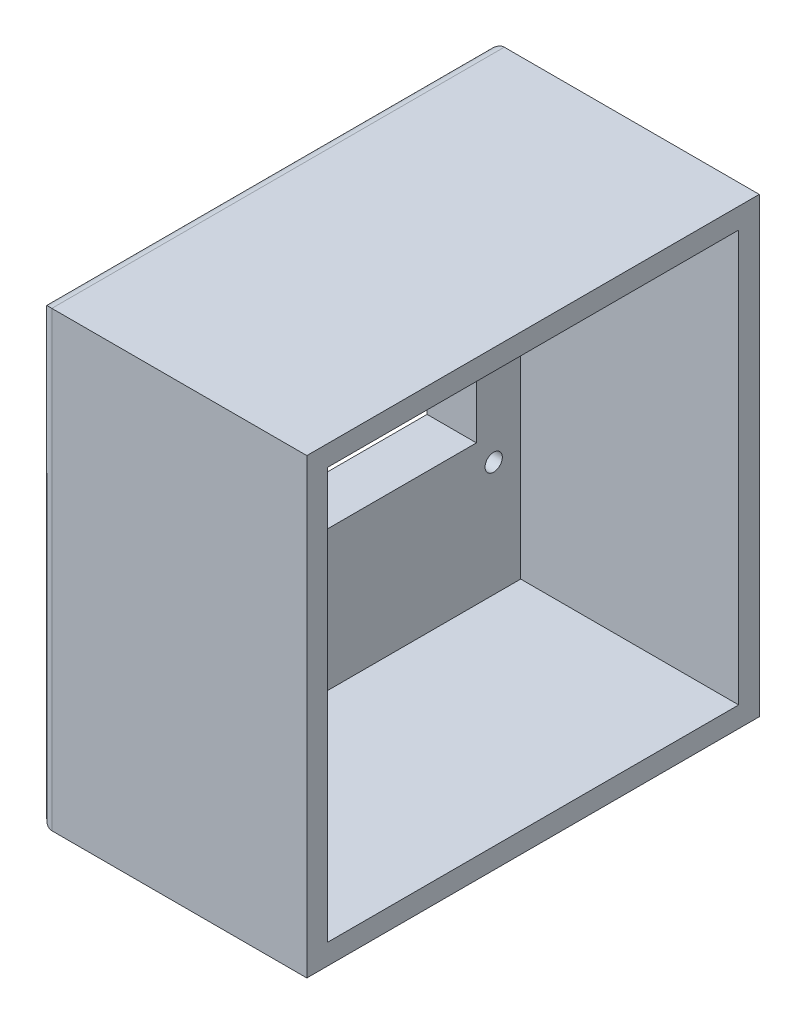
ISO-10303-21;
HEADER;
FILE_DESCRIPTION(('STEP AP214'),'2;1');
FILE_NAME('part.step','',(''),(''),'','','');
FILE_SCHEMA(('AUTOMOTIVE_DESIGN { 1 0 10303 214 1 1 1 1 }'));
ENDSEC;
DATA;
#1=APPLICATION_CONTEXT('core data for automotive mechanical design processes');
#2=APPLICATION_PROTOCOL_DEFINITION('international standard','automotive_design',2000,#1);
#3=PRODUCT_CONTEXT('',#1,'mechanical');
#4=PRODUCT('Part','Part','',(#3));
#5=PRODUCT_RELATED_PRODUCT_CATEGORY('part','',(#4));
#6=PRODUCT_DEFINITION_FORMATION('','',#4);
#7=PRODUCT_DEFINITION_CONTEXT('part definition',#1,'design');
#8=PRODUCT_DEFINITION('design','',#6,#7);
#9=PRODUCT_DEFINITION_SHAPE('','',#8);
#10=(LENGTH_UNIT() NAMED_UNIT(*) SI_UNIT(.MILLI.,.METRE.));
#11=(NAMED_UNIT(*) PLANE_ANGLE_UNIT() SI_UNIT($,.RADIAN.));
#12=(NAMED_UNIT(*) SI_UNIT($,.STERADIAN.) SOLID_ANGLE_UNIT());
#13=UNCERTAINTY_MEASURE_WITH_UNIT(LENGTH_MEASURE(1.E-05),#10,'distance_accuracy_value','');
#14=(GEOMETRIC_REPRESENTATION_CONTEXT(3) GLOBAL_UNCERTAINTY_ASSIGNED_CONTEXT((#13)) GLOBAL_UNIT_ASSIGNED_CONTEXT((#10,
#11,#12)) REPRESENTATION_CONTEXT('',''));
#15=CARTESIAN_POINT('',(0.,0.,0.));
#16=DIRECTION('',(0.,0.,1.));
#17=DIRECTION('',(1.,0.,0.));
#18=AXIS2_PLACEMENT_3D('',#15,#16,#17);
#19=CARTESIAN_POINT('',(12.,0.,0.));
#20=DIRECTION('',(-1.,0.,0.));
#21=DIRECTION('',(0.,0.,1.));
#22=AXIS2_PLACEMENT_3D('',#19,#20,#21);
#23=PLANE('',#22);
#24=DIRECTION('',(0.,0.,-1.));
#25=VECTOR('',#24,1.);
#26=CARTESIAN_POINT('',(12.,426.298918518807,375.220911044609));
#27=LINE('',#26,#25);
#28=CARTESIAN_POINT('',(12.,426.298918518807,455.220911044609));
#29=VERTEX_POINT('',#28);
#30=CARTESIAN_POINT('',(12.,426.298918518807,375.220911044609));
#31=VERTEX_POINT('',#30);
#32=EDGE_CURVE('E205',#29,#31,#27,.T.);
#33=ORIENTED_EDGE('',*,*,#32,.T.);
#34=DIRECTION('',(0.,-1.,0.));
#35=VECTOR('',#34,1.);
#36=CARTESIAN_POINT('',(12.,426.298918518807,375.220911044609));
#37=LINE('',#36,#35);
#38=CARTESIAN_POINT('',(12.,373.298918518807,375.220911044609));
#39=VERTEX_POINT('',#38);
#40=EDGE_CURVE('E195',#31,#39,#37,.T.);
#41=ORIENTED_EDGE('',*,*,#40,.T.);
#42=DIRECTION('',(0.,0.,1.));
#43=VECTOR('',#42,1.);
#44=CARTESIAN_POINT('',(12.,373.298918518807,375.220911044609));
#45=LINE('',#44,#43);
#46=CARTESIAN_POINT('',(12.,373.298918518807,455.220911044609));
#47=VERTEX_POINT('',#46);
#48=EDGE_CURVE('E198',#39,#47,#45,.T.);
#49=ORIENTED_EDGE('',*,*,#48,.T.);
#50=DIRECTION('',(0.,1.,0.));
#51=VECTOR('',#50,1.);
#52=CARTESIAN_POINT('',(12.,426.298918518807,455.220911044609));
#53=LINE('',#52,#51);
#54=EDGE_CURVE('E202',#47,#29,#53,.T.);
#55=ORIENTED_EDGE('',*,*,#54,.T.);
#56=EDGE_LOOP('',(#33,#41,#49,#55));
#57=FACE_BOUND('',#56,.T.);
#58=DIRECTION('',(0.,1.,0.));
#59=VECTOR('',#58,1.);
#60=CARTESIAN_POINT('',(12.,439.240771296059,364.454548573401));
#61=LINE('',#60,#59);
#62=CARTESIAN_POINT('',(12.,339.240771296059,364.454548573401));
#63=VERTEX_POINT('',#62);
#64=CARTESIAN_POINT('',(12.,439.240771296059,364.454548573401));
#65=VERTEX_POINT('',#64);
#66=EDGE_CURVE('E260',#63,#65,#61,.T.);
#67=ORIENTED_EDGE('',*,*,#66,.T.);
#68=DIRECTION('',(0.,0.,1.));
#69=VECTOR('',#68,1.);
#70=CARTESIAN_POINT('',(12.,439.240771296059,364.454548573401));
#71=LINE('',#70,#69);
#72=CARTESIAN_POINT('',(12.,439.240771296059,464.454548573401));
#73=VERTEX_POINT('',#72);
#74=EDGE_CURVE('E143',#65,#73,#71,.T.);
#75=ORIENTED_EDGE('',*,*,#74,.T.);
#76=DIRECTION('',(0.,-1.,0.));
#77=VECTOR('',#76,1.);
#78=CARTESIAN_POINT('',(12.,439.240771296059,464.454548573401));
#79=LINE('',#78,#77);
#80=CARTESIAN_POINT('',(12.,339.240771296059,464.454548573401));
#81=VERTEX_POINT('',#80);
#82=EDGE_CURVE('E265',#73,#81,#79,.T.);
#83=ORIENTED_EDGE('',*,*,#82,.T.);
#84=DIRECTION('',(0.,0.,-1.));
#85=VECTOR('',#84,1.);
#86=CARTESIAN_POINT('',(12.,339.240771296059,364.454548573401));
#87=LINE('',#86,#85);
#88=EDGE_CURVE('E268',#81,#63,#87,.T.);
#89=ORIENTED_EDGE('',*,*,#88,.T.);
#90=EDGE_LOOP('',(#67,#75,#83,#89));
#91=FACE_BOUND('',#90,.T.);
#92=CARTESIAN_POINT('',(12.,432.946200958038,371.07798761228));
#93=DIRECTION('',(1.,0.,0.));
#94=DIRECTION('',(0.,0.,-1.));
#95=AXIS2_PLACEMENT_3D('',#92,#93,#94);
#96=CIRCLE('',#95,2.09999973149244);
#97=CARTESIAN_POINT('',(12.,432.946200958038,368.977987880788));
#98=VERTEX_POINT('',#97);
#99=EDGE_CURVE('E257',#98,#98,#96,.T.);
#100=ORIENTED_EDGE('',*,*,#99,.F.);
#101=EDGE_LOOP('',(#100));
#102=FACE_BOUND('',#101,.T.);
#103=CARTESIAN_POINT('',(12.,367.14624514987,371.024063378591));
#104=DIRECTION('',(1.,0.,0.));
#105=DIRECTION('',(0.,0.,-1.));
#106=AXIS2_PLACEMENT_3D('',#103,#104,#105);
#107=CIRCLE('',#106,2.09999973149239);
#108=CARTESIAN_POINT('',(12.,367.14624514987,368.924063647098));
#109=VERTEX_POINT('',#108);
#110=EDGE_CURVE('E251',#109,#109,#107,.T.);
#111=ORIENTED_EDGE('',*,*,#110,.F.);
#112=EDGE_LOOP('',(#111));
#113=FACE_BOUND('',#112,.T.);
#114=CARTESIAN_POINT('',(12.,432.874247380097,458.877958128662));
#115=DIRECTION('',(1.,0.,0.));
#116=DIRECTION('',(0.,0.,-1.));
#117=AXIS2_PLACEMENT_3D('',#114,#115,#116);
#118=CIRCLE('',#117,2.09999973149244);
#119=CARTESIAN_POINT('',(12.,432.874247380097,456.777958397169));
#120=VERTEX_POINT('',#119);
#121=EDGE_CURVE('E245',#120,#120,#118,.T.);
#122=ORIENTED_EDGE('',*,*,#121,.F.);
#123=EDGE_LOOP('',(#122));
#124=FACE_BOUND('',#123,.T.);
#125=CARTESIAN_POINT('',(12.,367.074291571929,458.824033894972));
#126=DIRECTION('',(1.,0.,0.));
#127=DIRECTION('',(0.,0.,-1.));
#128=AXIS2_PLACEMENT_3D('',#125,#126,#127);
#129=CIRCLE('',#128,2.09999973149244);
#130=CARTESIAN_POINT('',(12.,367.074291571929,456.724034163479));
#131=VERTEX_POINT('',#130);
#132=EDGE_CURVE('E239',#131,#131,#129,.T.);
#133=ORIENTED_EDGE('',*,*,#132,.F.);
#134=EDGE_LOOP('',(#133));
#135=FACE_BOUND('',#134,.T.);
#136=CARTESIAN_POINT('',(12.,356.487124133319,451.165348634311));
#137=DIRECTION('',(1.,0.,0.));
#138=DIRECTION('',(0.,0.,-1.));
#139=AXIS2_PLACEMENT_3D('',#136,#137,#138);
#140=CIRCLE('',#139,3.49999949639457);
#141=CARTESIAN_POINT('',(12.,356.487124133319,447.665349137916));
#142=VERTEX_POINT('',#141);
#143=EDGE_CURVE('E233',#142,#142,#140,.T.);
#144=ORIENTED_EDGE('',*,*,#143,.F.);
#145=EDGE_LOOP('',(#144));
#146=FACE_BOUND('',#145,.T.);
#147=CARTESIAN_POINT('',(12.,356.508431567425,418.165360481469));
#148=DIRECTION('',(1.,0.,0.));
#149=DIRECTION('',(0.,0.,-1.));
#150=AXIS2_PLACEMENT_3D('',#147,#148,#149);
#151=CIRCLE('',#150,3.39999976505584);
#152=CARTESIAN_POINT('',(12.,356.508431567425,414.765360716413));
#153=VERTEX_POINT('',#152);
#154=EDGE_CURVE('E227',#153,#153,#151,.T.);
#155=ORIENTED_EDGE('',*,*,#154,.F.);
#156=EDGE_LOOP('',(#155));
#157=FACE_BOUND('',#156,.T.);
#158=ADVANCED_FACE('F33',(#57,#91,#102,#113,#124,#135,#146,#157),#23,.F.);
#159=CARTESIAN_POINT('',(0.,0.,0.));
#160=DIRECTION('',(-1.,0.,0.));
#161=DIRECTION('',(0.,0.,1.));
#162=AXIS2_PLACEMENT_3D('',#159,#160,#161);
#163=PLANE('',#162);
#164=DIRECTION('',(0.,-1.,0.));
#165=VECTOR('',#164,1.);
#166=CARTESIAN_POINT('',(0.,0.,362.454548573401));
#167=LINE('',#166,#165);
#168=CARTESIAN_POINT('',(0.,441.240771296059,362.454548573401));
#169=VERTEX_POINT('',#168);
#170=CARTESIAN_POINT('',(0.,337.240771296059,362.454548573401));
#171=VERTEX_POINT('',#170);
#172=EDGE_CURVE('E275',#169,#171,#167,.T.);
#173=ORIENTED_EDGE('',*,*,#172,.T.);
#174=DIRECTION('',(0.,0.,1.));
#175=VECTOR('',#174,1.);
#176=CARTESIAN_POINT('',(0.,337.240771296059,0.));
#177=LINE('',#176,#175);
#178=CARTESIAN_POINT('',(0.,337.240771296059,466.454548573401));
#179=VERTEX_POINT('',#178);
#180=EDGE_CURVE('E277',#171,#179,#177,.T.);
#181=ORIENTED_EDGE('',*,*,#180,.T.);
#182=DIRECTION('',(0.,1.,0.));
#183=VECTOR('',#182,1.);
#184=CARTESIAN_POINT('',(0.,0.,466.454548573401));
#185=LINE('',#184,#183);
#186=CARTESIAN_POINT('',(0.,441.240771296059,466.454548573401));
#187=VERTEX_POINT('',#186);
#188=EDGE_CURVE('E271',#179,#187,#185,.T.);
#189=ORIENTED_EDGE('',*,*,#188,.T.);
#190=DIRECTION('',(0.,0.,-1.));
#191=VECTOR('',#190,1.);
#192=CARTESIAN_POINT('',(0.,441.240771296059,0.));
#193=LINE('',#192,#191);
#194=EDGE_CURVE('E273',#187,#169,#193,.T.);
#195=ORIENTED_EDGE('',*,*,#194,.T.);
#196=EDGE_LOOP('',(#173,#181,#189,#195));
#197=FACE_BOUND('',#196,.T.);
#198=DIRECTION('',(0.,-1.,0.));
#199=VECTOR('',#198,1.);
#200=CARTESIAN_POINT('',(0.,426.298918518807,375.220911044609));
#201=LINE('',#200,#199);
#202=CARTESIAN_POINT('',(0.,426.298918518807,375.220911044609));
#203=VERTEX_POINT('',#202);
#204=CARTESIAN_POINT('',(0.,373.298918518807,375.220911044609));
#205=VERTEX_POINT('',#204);
#206=EDGE_CURVE('E188',#203,#205,#201,.T.);
#207=ORIENTED_EDGE('',*,*,#206,.F.);
#208=DIRECTION('',(0.,0.,-1.));
#209=VECTOR('',#208,1.);
#210=CARTESIAN_POINT('',(0.,426.298918518807,375.220911044609));
#211=LINE('',#210,#209);
#212=CARTESIAN_POINT('',(0.,426.298918518807,455.220911044609));
#213=VERTEX_POINT('',#212);
#214=EDGE_CURVE('E199',#213,#203,#211,.T.);
#215=ORIENTED_EDGE('',*,*,#214,.F.);
#216=DIRECTION('',(0.,1.,0.));
#217=VECTOR('',#216,1.);
#218=CARTESIAN_POINT('',(0.,426.298918518807,455.220911044609));
#219=LINE('',#218,#217);
#220=CARTESIAN_POINT('',(0.,373.298918518807,455.220911044609));
#221=VERTEX_POINT('',#220);
#222=EDGE_CURVE('E213',#221,#213,#219,.T.);
#223=ORIENTED_EDGE('',*,*,#222,.F.);
#224=DIRECTION('',(0.,0.,1.));
#225=VECTOR('',#224,1.);
#226=CARTESIAN_POINT('',(0.,373.298918518807,375.220911044609));
#227=LINE('',#226,#225);
#228=EDGE_CURVE('E210',#205,#221,#227,.T.);
#229=ORIENTED_EDGE('',*,*,#228,.F.);
#230=EDGE_LOOP('',(#207,#215,#223,#229));
#231=FACE_BOUND('',#230,.T.);
#232=CARTESIAN_POINT('',(0.,356.487124133319,451.165348634311));
#233=DIRECTION('',(1.,0.,0.));
#234=DIRECTION('',(0.,0.,-1.));
#235=AXIS2_PLACEMENT_3D('',#232,#233,#234);
#236=CIRCLE('',#235,3.49999949639457);
#237=CARTESIAN_POINT('',(0.,356.487124133319,447.665349137916));
#238=VERTEX_POINT('',#237);
#239=EDGE_CURVE('E230',#238,#238,#236,.T.);
#240=ORIENTED_EDGE('',*,*,#239,.T.);
#241=EDGE_LOOP('',(#240));
#242=FACE_BOUND('',#241,.T.);
#243=CARTESIAN_POINT('',(0.,432.874247380097,458.877958128662));
#244=DIRECTION('',(1.,0.,0.));
#245=DIRECTION('',(0.,0.,-1.));
#246=AXIS2_PLACEMENT_3D('',#243,#244,#245);
#247=CIRCLE('',#246,2.09999973149244);
#248=CARTESIAN_POINT('',(0.,432.874247380097,456.777958397169));
#249=VERTEX_POINT('',#248);
#250=EDGE_CURVE('E242',#249,#249,#247,.T.);
#251=ORIENTED_EDGE('',*,*,#250,.T.);
#252=EDGE_LOOP('',(#251));
#253=FACE_BOUND('',#252,.T.);
#254=CARTESIAN_POINT('',(0.,432.946200958038,371.07798761228));
#255=DIRECTION('',(1.,0.,0.));
#256=DIRECTION('',(0.,0.,-1.));
#257=AXIS2_PLACEMENT_3D('',#254,#255,#256);
#258=CIRCLE('',#257,2.09999973149244);
#259=CARTESIAN_POINT('',(0.,432.946200958038,368.977987880788));
#260=VERTEX_POINT('',#259);
#261=EDGE_CURVE('E254',#260,#260,#258,.T.);
#262=ORIENTED_EDGE('',*,*,#261,.T.);
#263=EDGE_LOOP('',(#262));
#264=FACE_BOUND('',#263,.T.);
#265=CARTESIAN_POINT('',(0.,367.14624514987,371.024063378591));
#266=DIRECTION('',(1.,0.,0.));
#267=DIRECTION('',(0.,0.,-1.));
#268=AXIS2_PLACEMENT_3D('',#265,#266,#267);
#269=CIRCLE('',#268,2.09999973149239);
#270=CARTESIAN_POINT('',(0.,367.14624514987,368.924063647098));
#271=VERTEX_POINT('',#270);
#272=EDGE_CURVE('E248',#271,#271,#269,.T.);
#273=ORIENTED_EDGE('',*,*,#272,.T.);
#274=EDGE_LOOP('',(#273));
#275=FACE_BOUND('',#274,.T.);
#276=CARTESIAN_POINT('',(0.,367.074291571929,458.824033894972));
#277=DIRECTION('',(1.,0.,0.));
#278=DIRECTION('',(0.,0.,-1.));
#279=AXIS2_PLACEMENT_3D('',#276,#277,#278);
#280=CIRCLE('',#279,2.09999973149244);
#281=CARTESIAN_POINT('',(0.,367.074291571929,456.724034163479));
#282=VERTEX_POINT('',#281);
#283=EDGE_CURVE('E236',#282,#282,#280,.T.);
#284=ORIENTED_EDGE('',*,*,#283,.T.);
#285=EDGE_LOOP('',(#284));
#286=FACE_BOUND('',#285,.T.);
#287=CARTESIAN_POINT('',(0.,356.508431567425,418.165360481469));
#288=DIRECTION('',(1.,0.,0.));
#289=DIRECTION('',(0.,0.,-1.));
#290=AXIS2_PLACEMENT_3D('',#287,#288,#289);
#291=CIRCLE('',#290,3.39999976505584);
#292=CARTESIAN_POINT('',(0.,356.508431567425,414.765360716413));
#293=VERTEX_POINT('',#292);
#294=EDGE_CURVE('E220',#293,#293,#291,.T.);
#295=ORIENTED_EDGE('',*,*,#294,.T.);
#296=EDGE_LOOP('',(#295));
#297=FACE_BOUND('',#296,.T.);
#298=ADVANCED_FACE('F300',(#197,#231,#242,#253,#264,#275,#286,#297),#163,.T.);
#299=CARTESIAN_POINT('',(12.,432.946200958038,371.07798761228));
#300=DIRECTION('',(-1.,0.,0.));
#301=DIRECTION('',(0.,0.,1.));
#302=AXIS2_PLACEMENT_3D('',#299,#300,#301);
#303=CYLINDRICAL_SURFACE('',#302,2.09999973149244);
#304=ORIENTED_EDGE('',*,*,#99,.T.);
#305=EDGE_LOOP('',(#304));
#306=FACE_BOUND('',#305,.T.);
#307=ORIENTED_EDGE('',*,*,#261,.F.);
#308=EDGE_LOOP('',(#307));
#309=FACE_BOUND('',#308,.T.);
#310=ADVANCED_FACE('F334',(#306,#309),#303,.F.);
#311=CARTESIAN_POINT('',(12.,367.14624514987,371.024063378591));
#312=DIRECTION('',(-1.,0.,0.));
#313=DIRECTION('',(0.,0.,1.));
#314=AXIS2_PLACEMENT_3D('',#311,#312,#313);
#315=CYLINDRICAL_SURFACE('',#314,2.09999973149239);
#316=ORIENTED_EDGE('',*,*,#110,.T.);
#317=EDGE_LOOP('',(#316));
#318=FACE_BOUND('',#317,.T.);
#319=ORIENTED_EDGE('',*,*,#272,.F.);
#320=EDGE_LOOP('',(#319));
#321=FACE_BOUND('',#320,.T.);
#322=ADVANCED_FACE('F409',(#318,#321),#315,.F.);
#323=CARTESIAN_POINT('',(12.,432.874247380097,458.877958128662));
#324=DIRECTION('',(-1.,0.,0.));
#325=DIRECTION('',(0.,0.,1.));
#326=AXIS2_PLACEMENT_3D('',#323,#324,#325);
#327=CYLINDRICAL_SURFACE('',#326,2.09999973149244);
#328=ORIENTED_EDGE('',*,*,#121,.T.);
#329=EDGE_LOOP('',(#328));
#330=FACE_BOUND('',#329,.T.);
#331=ORIENTED_EDGE('',*,*,#250,.F.);
#332=EDGE_LOOP('',(#331));
#333=FACE_BOUND('',#332,.T.);
#334=ADVANCED_FACE('F406',(#330,#333),#327,.F.);
#335=CARTESIAN_POINT('',(12.,367.074291571929,458.824033894972));
#336=DIRECTION('',(-1.,0.,0.));
#337=DIRECTION('',(0.,0.,1.));
#338=AXIS2_PLACEMENT_3D('',#335,#336,#337);
#339=CYLINDRICAL_SURFACE('',#338,2.09999973149244);
#340=ORIENTED_EDGE('',*,*,#132,.T.);
#341=EDGE_LOOP('',(#340));
#342=FACE_BOUND('',#341,.T.);
#343=ORIENTED_EDGE('',*,*,#283,.F.);
#344=EDGE_LOOP('',(#343));
#345=FACE_BOUND('',#344,.T.);
#346=ADVANCED_FACE('F399',(#342,#345),#339,.F.);
#347=CARTESIAN_POINT('',(12.,356.487124133319,451.165348634311));
#348=DIRECTION('',(-1.,0.,0.));
#349=DIRECTION('',(0.,0.,1.));
#350=AXIS2_PLACEMENT_3D('',#347,#348,#349);
#351=CYLINDRICAL_SURFACE('',#350,3.49999949639457);
#352=ORIENTED_EDGE('',*,*,#143,.T.);
#353=EDGE_LOOP('',(#352));
#354=FACE_BOUND('',#353,.T.);
#355=ORIENTED_EDGE('',*,*,#239,.F.);
#356=EDGE_LOOP('',(#355));
#357=FACE_BOUND('',#356,.T.);
#358=ADVANCED_FACE('F388',(#354,#357),#351,.F.);
#359=CARTESIAN_POINT('',(12.,356.508431567425,418.165360481469));
#360=DIRECTION('',(-1.,0.,0.));
#361=DIRECTION('',(0.,0.,1.));
#362=AXIS2_PLACEMENT_3D('',#359,#360,#361);
#363=CYLINDRICAL_SURFACE('',#362,3.39999976505584);
#364=ORIENTED_EDGE('',*,*,#154,.T.);
#365=EDGE_LOOP('',(#364));
#366=FACE_BOUND('',#365,.T.);
#367=ORIENTED_EDGE('',*,*,#294,.F.);
#368=EDGE_LOOP('',(#367));
#369=FACE_BOUND('',#368,.T.);
#370=ADVANCED_FACE('F384',(#366,#369),#363,.F.);
#371=CARTESIAN_POINT('',(12.,426.298918518807,375.220911044609));
#372=DIRECTION('',(0.,0.,-1.));
#373=DIRECTION('',(-1.,0.,0.));
#374=AXIS2_PLACEMENT_3D('',#371,#372,#373);
#375=PLANE('',#374);
#376=ORIENTED_EDGE('',*,*,#206,.T.);
#377=DIRECTION('',(-1.,0.,0.));
#378=VECTOR('',#377,1.);
#379=CARTESIAN_POINT('',(12.,373.298918518807,375.220911044609));
#380=LINE('',#379,#378);
#381=EDGE_CURVE('E208',#39,#205,#380,.T.);
#382=ORIENTED_EDGE('',*,*,#381,.F.);
#383=ORIENTED_EDGE('',*,*,#40,.F.);
#384=DIRECTION('',(-1.,0.,0.));
#385=VECTOR('',#384,1.);
#386=CARTESIAN_POINT('',(12.,426.298918518807,375.220911044609));
#387=LINE('',#386,#385);
#388=EDGE_CURVE('E218',#31,#203,#387,.T.);
#389=ORIENTED_EDGE('',*,*,#388,.T.);
#390=EDGE_LOOP('',(#376,#382,#383,#389));
#391=FACE_BOUND('',#390,.T.);
#392=ADVANCED_FACE('F387',(#391),#375,.F.);
#393=CARTESIAN_POINT('',(12.,426.298918518807,375.220911044609));
#394=DIRECTION('',(0.,1.,0.));
#395=DIRECTION('',(0.,0.,1.));
#396=AXIS2_PLACEMENT_3D('',#393,#394,#395);
#397=PLANE('',#396);
#398=ORIENTED_EDGE('',*,*,#214,.T.);
#399=ORIENTED_EDGE('',*,*,#388,.F.);
#400=ORIENTED_EDGE('',*,*,#32,.F.);
#401=DIRECTION('',(-1.,0.,0.));
#402=VECTOR('',#401,1.);
#403=CARTESIAN_POINT('',(12.,426.298918518807,455.220911044609));
#404=LINE('',#403,#402);
#405=EDGE_CURVE('E221',#29,#213,#404,.T.);
#406=ORIENTED_EDGE('',*,*,#405,.T.);
#407=EDGE_LOOP('',(#398,#399,#400,#406));
#408=FACE_BOUND('',#407,.T.);
#409=ADVANCED_FACE('F396',(#408),#397,.F.);
#410=CARTESIAN_POINT('',(12.,426.298918518807,455.220911044609));
#411=DIRECTION('',(0.,0.,1.));
#412=DIRECTION('',(1.,0.,0.));
#413=AXIS2_PLACEMENT_3D('',#410,#411,#412);
#414=PLANE('',#413);
#415=ORIENTED_EDGE('',*,*,#222,.T.);
#416=ORIENTED_EDGE('',*,*,#405,.F.);
#417=ORIENTED_EDGE('',*,*,#54,.F.);
#418=DIRECTION('',(-1.,0.,0.));
#419=VECTOR('',#418,1.);
#420=CARTESIAN_POINT('',(12.,373.298918518807,455.220911044609));
#421=LINE('',#420,#419);
#422=EDGE_CURVE('E223',#47,#221,#421,.T.);
#423=ORIENTED_EDGE('',*,*,#422,.T.);
#424=EDGE_LOOP('',(#415,#416,#417,#423));
#425=FACE_BOUND('',#424,.T.);
#426=ADVANCED_FACE('F479',(#425),#414,.F.);
#427=CARTESIAN_POINT('',(12.,373.298918518807,375.220911044609));
#428=DIRECTION('',(0.,-1.,0.));
#429=DIRECTION('',(0.,0.,-1.));
#430=AXIS2_PLACEMENT_3D('',#427,#428,#429);
#431=PLANE('',#430);
#432=ORIENTED_EDGE('',*,*,#228,.T.);
#433=ORIENTED_EDGE('',*,*,#422,.F.);
#434=ORIENTED_EDGE('',*,*,#48,.F.);
#435=ORIENTED_EDGE('',*,*,#381,.T.);
#436=EDGE_LOOP('',(#432,#433,#434,#435));
#437=FACE_BOUND('',#436,.T.);
#438=ADVANCED_FACE('F360',(#437),#431,.F.);
#439=CARTESIAN_POINT('',(65.,439.240771296059,464.454548573401));
#440=DIRECTION('',(0.,1.,0.));
#441=DIRECTION('',(0.,0.,1.));
#442=AXIS2_PLACEMENT_3D('',#439,#440,#441);
#443=PLANE('',#442);
#444=DIRECTION('',(-1.,0.,0.));
#445=VECTOR('',#444,1.);
#446=CARTESIAN_POINT('',(65.,439.240771296059,464.454548573401));
#447=LINE('',#446,#445);
#448=CARTESIAN_POINT('',(65.,439.240771296059,464.454548573401));
#449=VERTEX_POINT('',#448);
#450=EDGE_CURVE('E167',#449,#73,#447,.T.);
#451=ORIENTED_EDGE('',*,*,#450,.T.);
#452=ORIENTED_EDGE('',*,*,#74,.F.);
#453=DIRECTION('',(-1.,0.,0.));
#454=VECTOR('',#453,1.);
#455=CARTESIAN_POINT('',(65.,439.240771296059,364.454548573401));
#456=LINE('',#455,#454);
#457=CARTESIAN_POINT('',(65.,439.240771296059,364.454548573401));
#458=VERTEX_POINT('',#457);
#459=EDGE_CURVE('E135',#458,#65,#456,.T.);
#460=ORIENTED_EDGE('',*,*,#459,.F.);
#461=DIRECTION('',(0.,0.,-1.));
#462=VECTOR('',#461,1.);
#463=CARTESIAN_POINT('',(65.,439.240771296059,464.454548573401));
#464=LINE('',#463,#462);
#465=EDGE_CURVE('E140',#449,#458,#464,.T.);
#466=ORIENTED_EDGE('',*,*,#465,.F.);
#467=EDGE_LOOP('',(#451,#452,#460,#466));
#468=FACE_BOUND('',#467,.T.);
#469=ADVANCED_FACE('F138',(#468),#443,.F.);
#470=CARTESIAN_POINT('',(65.,339.240771296059,364.454548573401));
#471=DIRECTION('',(0.,-1.,0.));
#472=DIRECTION('',(0.,0.,-1.));
#473=AXIS2_PLACEMENT_3D('',#470,#471,#472);
#474=PLANE('',#473);
#475=DIRECTION('',(-1.,0.,0.));
#476=VECTOR('',#475,1.);
#477=CARTESIAN_POINT('',(65.,339.240771296059,364.454548573401));
#478=LINE('',#477,#476);
#479=CARTESIAN_POINT('',(65.,339.240771296059,364.454548573401));
#480=VERTEX_POINT('',#479);
#481=EDGE_CURVE('E146',#480,#63,#478,.T.);
#482=ORIENTED_EDGE('',*,*,#481,.T.);
#483=ORIENTED_EDGE('',*,*,#88,.F.);
#484=DIRECTION('',(-1.,0.,0.));
#485=VECTOR('',#484,1.);
#486=CARTESIAN_POINT('',(65.,339.240771296059,464.454548573401));
#487=LINE('',#486,#485);
#488=CARTESIAN_POINT('',(65.,339.240771296059,464.454548573401));
#489=VERTEX_POINT('',#488);
#490=EDGE_CURVE('E170',#489,#81,#487,.T.);
#491=ORIENTED_EDGE('',*,*,#490,.F.);
#492=DIRECTION('',(0.,0.,1.));
#493=VECTOR('',#492,1.);
#494=CARTESIAN_POINT('',(65.,339.240771296059,364.454548573401));
#495=LINE('',#494,#493);
#496=EDGE_CURVE('E156',#480,#489,#495,.T.);
#497=ORIENTED_EDGE('',*,*,#496,.F.);
#498=EDGE_LOOP('',(#482,#483,#491,#497));
#499=FACE_BOUND('',#498,.T.);
#500=ADVANCED_FACE('F359',(#499),#474,.F.);
#501=CARTESIAN_POINT('',(65.,339.240771296059,464.454548573401));
#502=DIRECTION('',(0.,0.,1.));
#503=DIRECTION('',(1.,0.,0.));
#504=AXIS2_PLACEMENT_3D('',#501,#502,#503);
#505=PLANE('',#504);
#506=ORIENTED_EDGE('',*,*,#490,.T.);
#507=ORIENTED_EDGE('',*,*,#82,.F.);
#508=ORIENTED_EDGE('',*,*,#450,.F.);
#509=DIRECTION('',(0.,1.,0.));
#510=VECTOR('',#509,1.);
#511=CARTESIAN_POINT('',(65.,339.240771296059,464.454548573401));
#512=LINE('',#511,#510);
#513=EDGE_CURVE('E147',#489,#449,#512,.T.);
#514=ORIENTED_EDGE('',*,*,#513,.F.);
#515=EDGE_LOOP('',(#506,#507,#508,#514));
#516=FACE_BOUND('',#515,.T.);
#517=ADVANCED_FACE('F363',(#516),#505,.F.);
#518=CARTESIAN_POINT('',(65.,439.240771296059,364.454548573401));
#519=DIRECTION('',(0.,0.,-1.));
#520=DIRECTION('',(-1.,0.,0.));
#521=AXIS2_PLACEMENT_3D('',#518,#519,#520);
#522=PLANE('',#521);
#523=ORIENTED_EDGE('',*,*,#459,.T.);
#524=ORIENTED_EDGE('',*,*,#66,.F.);
#525=ORIENTED_EDGE('',*,*,#481,.F.);
#526=DIRECTION('',(0.,-1.,0.));
#527=VECTOR('',#526,1.);
#528=CARTESIAN_POINT('',(65.,439.240771296059,364.454548573401));
#529=LINE('',#528,#527);
#530=EDGE_CURVE('E151',#458,#480,#529,.T.);
#531=ORIENTED_EDGE('',*,*,#530,.F.);
#532=EDGE_LOOP('',(#523,#524,#525,#531));
#533=FACE_BOUND('',#532,.T.);
#534=ADVANCED_FACE('F152',(#533),#522,.F.);
#535=CARTESIAN_POINT('',(65.,444.240771296059,469.454548573401));
#536=DIRECTION('',(0.,1.,0.));
#537=DIRECTION('',(0.,0.,1.));
#538=AXIS2_PLACEMENT_3D('',#535,#536,#537);
#539=PLANE('',#538);
#540=DIRECTION('',(-1.,0.,0.));
#541=VECTOR('',#540,1.);
#542=CARTESIAN_POINT('',(65.,444.240771296059,359.454548573401));
#543=LINE('',#542,#541);
#544=CARTESIAN_POINT('',(65.,444.240771296059,359.454548573401));
#545=VERTEX_POINT('',#544);
#546=CARTESIAN_POINT('',(3.,444.240771296059,359.454548573401));
#547=VERTEX_POINT('',#546);
#548=EDGE_CURVE('E185',#545,#547,#543,.T.);
#549=ORIENTED_EDGE('',*,*,#548,.T.);
#550=DIRECTION('',(0.,0.,-1.));
#551=VECTOR('',#550,1.);
#552=CARTESIAN_POINT('',(3.,444.240771296059,469.454548573401));
#553=LINE('',#552,#551);
#554=CARTESIAN_POINT('',(3.,444.240771296059,469.454548573401));
#555=VERTEX_POINT('',#554);
#556=EDGE_CURVE('E42',#547,#555,#553,.F.);
#557=ORIENTED_EDGE('',*,*,#556,.T.);
#558=DIRECTION('',(-1.,0.,0.));
#559=VECTOR('',#558,1.);
#560=CARTESIAN_POINT('',(65.,444.240771296059,469.454548573401));
#561=LINE('',#560,#559);
#562=CARTESIAN_POINT('',(65.,444.240771296059,469.454548573401));
#563=VERTEX_POINT('',#562);
#564=EDGE_CURVE('E186',#563,#555,#561,.T.);
#565=ORIENTED_EDGE('',*,*,#564,.F.);
#566=DIRECTION('',(0.,0.,-1.));
#567=VECTOR('',#566,1.);
#568=CARTESIAN_POINT('',(65.,444.240771296059,469.454548573401));
#569=LINE('',#568,#567);
#570=EDGE_CURVE('E169',#563,#545,#569,.T.);
#571=ORIENTED_EDGE('',*,*,#570,.T.);
#572=EDGE_LOOP('',(#549,#557,#565,#571));
#573=FACE_BOUND('',#572,.T.);
#574=ADVANCED_FACE('F314',(#573),#539,.T.);
#575=CARTESIAN_POINT('',(65.,334.240771296059,469.454548573401));
#576=DIRECTION('',(0.,0.,1.));
#577=DIRECTION('',(1.,0.,0.));
#578=AXIS2_PLACEMENT_3D('',#575,#576,#577);
#579=PLANE('',#578);
#580=ORIENTED_EDGE('',*,*,#564,.T.);
#581=DIRECTION('',(0.,1.,0.));
#582=VECTOR('',#581,1.);
#583=CARTESIAN_POINT('',(3.,334.240771296059,469.454548573401));
#584=LINE('',#583,#582);
#585=CARTESIAN_POINT('',(3.,334.240771296059,469.454548573401));
#586=VERTEX_POINT('',#585);
#587=EDGE_CURVE('E11',#555,#586,#584,.F.);
#588=ORIENTED_EDGE('',*,*,#587,.T.);
#589=DIRECTION('',(-1.,0.,0.));
#590=VECTOR('',#589,1.);
#591=CARTESIAN_POINT('',(65.,334.240771296059,469.454548573401));
#592=LINE('',#591,#590);
#593=CARTESIAN_POINT('',(65.,334.240771296059,469.454548573401));
#594=VERTEX_POINT('',#593);
#595=EDGE_CURVE('E189',#594,#586,#592,.T.);
#596=ORIENTED_EDGE('',*,*,#595,.F.);
#597=DIRECTION('',(0.,1.,0.));
#598=VECTOR('',#597,1.);
#599=CARTESIAN_POINT('',(65.,334.240771296059,469.454548573401));
#600=LINE('',#599,#598);
#601=EDGE_CURVE('E182',#594,#563,#600,.T.);
#602=ORIENTED_EDGE('',*,*,#601,.T.);
#603=EDGE_LOOP('',(#580,#588,#596,#602));
#604=FACE_BOUND('',#603,.T.);
#605=ADVANCED_FACE('F316',(#604),#579,.T.);
#606=CARTESIAN_POINT('',(65.,334.240771296059,359.454548573401));
#607=DIRECTION('',(0.,-1.,0.));
#608=DIRECTION('',(0.,0.,-1.));
#609=AXIS2_PLACEMENT_3D('',#606,#607,#608);
#610=PLANE('',#609);
#611=ORIENTED_EDGE('',*,*,#595,.T.);
#612=DIRECTION('',(0.,0.,1.));
#613=VECTOR('',#612,1.);
#614=CARTESIAN_POINT('',(3.,334.240771296059,359.454548573401));
#615=LINE('',#614,#613);
#616=CARTESIAN_POINT('',(3.,334.240771296059,359.454548573401));
#617=VERTEX_POINT('',#616);
#618=EDGE_CURVE('E280',#586,#617,#615,.F.);
#619=ORIENTED_EDGE('',*,*,#618,.T.);
#620=DIRECTION('',(-1.,0.,0.));
#621=VECTOR('',#620,1.);
#622=CARTESIAN_POINT('',(65.,334.240771296059,359.454548573401));
#623=LINE('',#622,#621);
#624=CARTESIAN_POINT('',(65.,334.240771296059,359.454548573401));
#625=VERTEX_POINT('',#624);
#626=EDGE_CURVE('E192',#625,#617,#623,.T.);
#627=ORIENTED_EDGE('',*,*,#626,.F.);
#628=DIRECTION('',(0.,0.,1.));
#629=VECTOR('',#628,1.);
#630=CARTESIAN_POINT('',(65.,334.240771296059,359.454548573401));
#631=LINE('',#630,#629);
#632=EDGE_CURVE('E179',#625,#594,#631,.T.);
#633=ORIENTED_EDGE('',*,*,#632,.T.);
#634=EDGE_LOOP('',(#611,#619,#627,#633));
#635=FACE_BOUND('',#634,.T.);
#636=ADVANCED_FACE('F308',(#635),#610,.T.);
#637=CARTESIAN_POINT('',(65.,444.240771296059,359.454548573401));
#638=DIRECTION('',(0.,0.,-1.));
#639=DIRECTION('',(-1.,0.,0.));
#640=AXIS2_PLACEMENT_3D('',#637,#638,#639);
#641=PLANE('',#640);
#642=ORIENTED_EDGE('',*,*,#626,.T.);
#643=DIRECTION('',(0.,-1.,0.));
#644=VECTOR('',#643,1.);
#645=CARTESIAN_POINT('',(3.,444.240771296059,359.454548573401));
#646=LINE('',#645,#644);
#647=EDGE_CURVE('E57',#617,#547,#646,.F.);
#648=ORIENTED_EDGE('',*,*,#647,.T.);
#649=ORIENTED_EDGE('',*,*,#548,.F.);
#650=DIRECTION('',(0.,-1.,0.));
#651=VECTOR('',#650,1.);
#652=CARTESIAN_POINT('',(65.,444.240771296059,359.454548573401));
#653=LINE('',#652,#651);
#654=EDGE_CURVE('E176',#545,#625,#653,.T.);
#655=ORIENTED_EDGE('',*,*,#654,.T.);
#656=EDGE_LOOP('',(#642,#648,#649,#655));
#657=FACE_BOUND('',#656,.T.);
#658=ADVANCED_FACE('F310',(#657),#641,.T.);
#659=CARTESIAN_POINT('',(65.,0.,0.));
#660=DIRECTION('',(-1.,0.,0.));
#661=DIRECTION('',(0.,0.,1.));
#662=AXIS2_PLACEMENT_3D('',#659,#660,#661);
#663=PLANE('',#662);
#664=ORIENTED_EDGE('',*,*,#513,.T.);
#665=ORIENTED_EDGE('',*,*,#465,.T.);
#666=ORIENTED_EDGE('',*,*,#530,.T.);
#667=ORIENTED_EDGE('',*,*,#496,.T.);
#668=EDGE_LOOP('',(#664,#665,#666,#667));
#669=FACE_BOUND('',#668,.T.);
#670=ORIENTED_EDGE('',*,*,#570,.F.);
#671=ORIENTED_EDGE('',*,*,#601,.F.);
#672=ORIENTED_EDGE('',*,*,#632,.F.);
#673=ORIENTED_EDGE('',*,*,#654,.F.);
#674=EDGE_LOOP('',(#670,#671,#672,#673));
#675=FACE_BOUND('',#674,.T.);
#676=ADVANCED_FACE('F158',(#669,#675),#663,.F.);
#677=CARTESIAN_POINT('',(3.,441.240771296059,0.));
#678=DIRECTION('',(0.,0.,-1.));
#679=DIRECTION('',(-1.,0.,0.));
#680=AXIS2_PLACEMENT_3D('',#677,#678,#679);
#681=CYLINDRICAL_SURFACE('',#680,3.);
#682=CARTESIAN_POINT('',(3.,441.240771296059,466.454548573401));
#683=DIRECTION('',(0.,0.707106781186547,-0.707106781186547));
#684=DIRECTION('',(0.,0.707106781186547,0.707106781186547));
#685=AXIS2_PLACEMENT_3D('',#682,#683,#684);
#686=ELLIPSE('',#685,4.24264068711928,3.);
#687=EDGE_CURVE('E163',#555,#187,#686,.F.);
#688=ORIENTED_EDGE('',*,*,#687,.F.);
#689=ORIENTED_EDGE('',*,*,#556,.F.);
#690=CARTESIAN_POINT('',(3.,441.240771296059,362.454548573401));
#691=DIRECTION('',(0.,-0.707106781186547,-0.707106781186547));
#692=DIRECTION('',(0.,0.707106781186547,-0.707106781186547));
#693=AXIS2_PLACEMENT_3D('',#690,#691,#692);
#694=ELLIPSE('',#693,4.24264068711928,3.);
#695=EDGE_CURVE('E37',#169,#547,#694,.T.);
#696=ORIENTED_EDGE('',*,*,#695,.F.);
#697=ORIENTED_EDGE('',*,*,#194,.F.);
#698=EDGE_LOOP('',(#688,#689,#696,#697));
#699=FACE_BOUND('',#698,.T.);
#700=ADVANCED_FACE('F35',(#699),#681,.T.);
#701=CARTESIAN_POINT('',(3.,0.,362.454548573401));
#702=DIRECTION('',(0.,-1.,0.));
#703=DIRECTION('',(0.,0.,-1.));
#704=AXIS2_PLACEMENT_3D('',#701,#702,#703);
#705=CYLINDRICAL_SURFACE('',#704,3.);
#706=ORIENTED_EDGE('',*,*,#695,.T.);
#707=ORIENTED_EDGE('',*,*,#647,.F.);
#708=CARTESIAN_POINT('',(3.,337.240771296059,362.454548573401));
#709=DIRECTION('',(0.,-0.707106781186547,0.707106781186547));
#710=DIRECTION('',(0.,-0.707106781186547,-0.707106781186547));
#711=AXIS2_PLACEMENT_3D('',#708,#709,#710);
#712=ELLIPSE('',#711,4.24264068711928,3.);
#713=EDGE_CURVE('E287',#171,#617,#712,.T.);
#714=ORIENTED_EDGE('',*,*,#713,.F.);
#715=ORIENTED_EDGE('',*,*,#172,.F.);
#716=EDGE_LOOP('',(#706,#707,#714,#715));
#717=FACE_BOUND('',#716,.T.);
#718=ADVANCED_FACE('F343',(#717),#705,.T.);
#719=CARTESIAN_POINT('',(3.,0.,466.454548573401));
#720=DIRECTION('',(0.,1.,0.));
#721=DIRECTION('',(0.,0.,1.));
#722=AXIS2_PLACEMENT_3D('',#719,#720,#721);
#723=CYLINDRICAL_SURFACE('',#722,3.);
#724=ORIENTED_EDGE('',*,*,#687,.T.);
#725=ORIENTED_EDGE('',*,*,#188,.F.);
#726=CARTESIAN_POINT('',(3.,337.240771296059,466.454548573401));
#727=DIRECTION('',(0.,0.707106781186547,0.707106781186547));
#728=DIRECTION('',(0.,0.707106781186547,-0.707106781186547));
#729=AXIS2_PLACEMENT_3D('',#726,#727,#728);
#730=ELLIPSE('',#729,4.24264068711928,3.);
#731=EDGE_CURVE('E285',#586,#179,#730,.F.);
#732=ORIENTED_EDGE('',*,*,#731,.F.);
#733=ORIENTED_EDGE('',*,*,#587,.F.);
#734=EDGE_LOOP('',(#724,#725,#732,#733));
#735=FACE_BOUND('',#734,.T.);
#736=ADVANCED_FACE('F293',(#735),#723,.T.);
#737=CARTESIAN_POINT('',(3.,337.240771296059,0.));
#738=DIRECTION('',(0.,0.,1.));
#739=DIRECTION('',(1.,0.,0.));
#740=AXIS2_PLACEMENT_3D('',#737,#738,#739);
#741=CYLINDRICAL_SURFACE('',#740,3.);
#742=ORIENTED_EDGE('',*,*,#713,.T.);
#743=ORIENTED_EDGE('',*,*,#618,.F.);
#744=ORIENTED_EDGE('',*,*,#731,.T.);
#745=ORIENTED_EDGE('',*,*,#180,.F.);
#746=EDGE_LOOP('',(#742,#743,#744,#745));
#747=FACE_BOUND('',#746,.T.);
#748=ADVANCED_FACE('F305',(#747),#741,.T.);
#749=CLOSED_SHELL('',(#158,#298,#310,#322,#334,#346,#358,#370,#392,#409,#426,#438,#469,#500,
#517,#534,#574,#605,#636,#658,#676,#700,#718,#736,#748));
#750=MANIFOLD_SOLID_BREP('B2',#749);
#751=ADVANCED_BREP_SHAPE_REPRESENTATION('',(#18,#750),#14);
#752=SHAPE_DEFINITION_REPRESENTATION(#9,#751);
ENDSEC;
END-ISO-10303-21;
